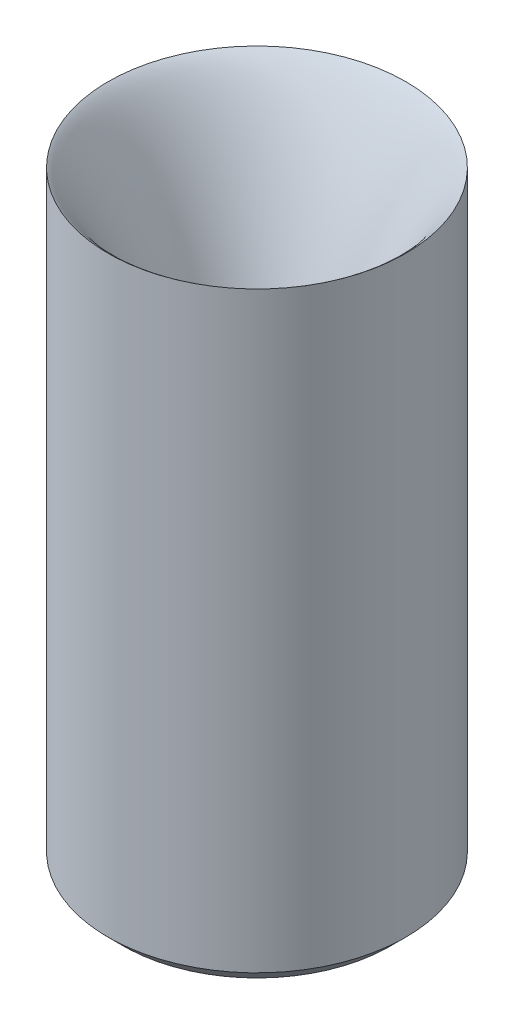
ISO-10303-21;
HEADER;
FILE_DESCRIPTION(('STEP AP214'),'2;1');
FILE_NAME('part.step','',(''),(''),'','','');
FILE_SCHEMA(('AUTOMOTIVE_DESIGN { 1 0 10303 214 1 1 1 1 }'));
ENDSEC;
DATA;
#1=APPLICATION_CONTEXT('core data for automotive mechanical design processes');
#2=APPLICATION_PROTOCOL_DEFINITION('international standard','automotive_design',2000,#1);
#3=PRODUCT_CONTEXT('',#1,'mechanical');
#4=PRODUCT('Part','Part','',(#3));
#5=PRODUCT_RELATED_PRODUCT_CATEGORY('part','',(#4));
#6=PRODUCT_DEFINITION_FORMATION('','',#4);
#7=PRODUCT_DEFINITION_CONTEXT('part definition',#1,'design');
#8=PRODUCT_DEFINITION('design','',#6,#7);
#9=PRODUCT_DEFINITION_SHAPE('','',#8);
#10=(LENGTH_UNIT() NAMED_UNIT(*) SI_UNIT(.MILLI.,.METRE.));
#11=(NAMED_UNIT(*) PLANE_ANGLE_UNIT() SI_UNIT($,.RADIAN.));
#12=(NAMED_UNIT(*) SI_UNIT($,.STERADIAN.) SOLID_ANGLE_UNIT());
#13=UNCERTAINTY_MEASURE_WITH_UNIT(LENGTH_MEASURE(1.E-05),#10,'distance_accuracy_value','');
#14=(GEOMETRIC_REPRESENTATION_CONTEXT(3) GLOBAL_UNCERTAINTY_ASSIGNED_CONTEXT((#13)) GLOBAL_UNIT_ASSIGNED_CONTEXT((#10,
#11,#12)) REPRESENTATION_CONTEXT('',''));
#15=CARTESIAN_POINT('',(0.,0.,0.));
#16=DIRECTION('',(0.,0.,1.));
#17=DIRECTION('',(1.,0.,0.));
#18=AXIS2_PLACEMENT_3D('',#15,#16,#17);
#19=CARTESIAN_POINT('',(0.,0.,0.));
#20=DIRECTION('',(0.,-1.,0.));
#21=DIRECTION('',(0.,0.,-1.));
#22=AXIS2_PLACEMENT_3D('',#19,#20,#21);
#23=CYLINDRICAL_SURFACE('',#22,1.5);
#24=CARTESIAN_POINT('',(0.,1.,0.));
#25=DIRECTION('',(0.,-1.,0.));
#26=DIRECTION('',(0.,0.,-1.));
#27=AXIS2_PLACEMENT_3D('',#24,#25,#26);
#28=CIRCLE('',#27,1.5);
#29=CARTESIAN_POINT('',(0.,1.,-1.5));
#30=VERTEX_POINT('',#29);
#31=EDGE_CURVE('E10',#30,#30,#28,.T.);
#32=ORIENTED_EDGE('',*,*,#31,.T.);
#33=EDGE_LOOP('',(#32));
#34=FACE_BOUND('',#33,.T.);
#35=CARTESIAN_POINT('',(0.,8.,0.));
#36=DIRECTION('',(0.,-1.,0.));
#37=DIRECTION('',(0.,0.,-1.));
#38=AXIS2_PLACEMENT_3D('',#35,#36,#37);
#39=CIRCLE('',#38,1.5);
#40=CARTESIAN_POINT('',(0.,8.,-1.5));
#41=VERTEX_POINT('',#40);
#42=EDGE_CURVE('E56',#41,#41,#39,.T.);
#43=ORIENTED_EDGE('',*,*,#42,.F.);
#44=EDGE_LOOP('',(#43));
#45=FACE_BOUND('',#44,.T.);
#46=ADVANCED_FACE('F35',(#34,#45),#23,.F.);
#47=CARTESIAN_POINT('',(0.9,8.,0.));
#48=DIRECTION('',(0.,-1.,0.));
#49=DIRECTION('',(0.,0.,-1.));
#50=AXIS2_PLACEMENT_3D('',#47,#48,#49);
#51=PLANE('',#50);
#52=ORIENTED_EDGE('',*,*,#42,.T.);
#53=EDGE_LOOP('',(#52));
#54=FACE_BOUND('',#53,.T.);
#55=CARTESIAN_POINT('',(0.,8.,0.));
#56=DIRECTION('',(0.,-1.,0.));
#57=DIRECTION('',(0.,0.,-1.));
#58=AXIS2_PLACEMENT_3D('',#55,#56,#57);
#59=CIRCLE('',#58,0.9);
#60=CARTESIAN_POINT('',(0.,8.,-0.9));
#61=VERTEX_POINT('',#60);
#62=EDGE_CURVE('E59',#61,#61,#59,.T.);
#63=ORIENTED_EDGE('',*,*,#62,.F.);
#64=EDGE_LOOP('',(#63));
#65=FACE_BOUND('',#64,.T.);
#66=ADVANCED_FACE('F85',(#54,#65),#51,.T.);
#67=CARTESIAN_POINT('',(0.,0.,0.));
#68=DIRECTION('',(0.,-1.,0.));
#69=DIRECTION('',(0.,0.,-1.));
#70=AXIS2_PLACEMENT_3D('',#67,#68,#69);
#71=CYLINDRICAL_SURFACE('',#70,0.9);
#72=ORIENTED_EDGE('',*,*,#62,.T.);
#73=EDGE_LOOP('',(#72));
#74=FACE_BOUND('',#73,.T.);
#75=CARTESIAN_POINT('',(0.,10.9999999999999,0.));
#76=DIRECTION('',(0.,-1.,0.));
#77=DIRECTION('',(0.,0.,-1.));
#78=AXIS2_PLACEMENT_3D('',#75,#76,#77);
#79=CIRCLE('',#78,0.899999999999999);
#80=CARTESIAN_POINT('',(0.,10.9999999999999,-0.899999999999999));
#81=VERTEX_POINT('',#80);
#82=EDGE_CURVE('E62',#81,#81,#79,.T.);
#83=ORIENTED_EDGE('',*,*,#82,.F.);
#84=EDGE_LOOP('',(#83));
#85=FACE_BOUND('',#84,.T.);
#86=ADVANCED_FACE('F80',(#74,#85),#71,.F.);
#87=CARTESIAN_POINT('',(9.8,40.,0.));
#88=CARTESIAN_POINT('',(7.45385891871025,38.434475284479,0.));
#89=CARTESIAN_POINT('',(0.899999999999884,21.9999999999998,0.));
#90=CARTESIAN_POINT('',(0.899999999999999,10.9999999999999,0.));
#91=B_SPLINE_CURVE_WITH_KNOTS('',3,(#87,#88,#89,#90),.UNSPECIFIED.,.F.,.F.,(4,4),(0.,1.),.UNSPECIFIED.);
#92=CARTESIAN_POINT('',(0.,0.,0.));
#93=DIRECTION('',(0.,-1.,0.));
#94=AXIS1_PLACEMENT('',#92,#93);
#95=SURFACE_OF_REVOLUTION('',#91,#94);
#96=ORIENTED_EDGE('',*,*,#82,.T.);
#97=EDGE_LOOP('',(#96));
#98=FACE_BOUND('',#97,.T.);
#99=CARTESIAN_POINT('',(0.,40.,0.));
#100=DIRECTION('',(0.,-1.,0.));
#101=DIRECTION('',(0.,0.,-1.));
#102=AXIS2_PLACEMENT_3D('',#99,#100,#101);
#103=CIRCLE('',#102,9.8);
#104=CARTESIAN_POINT('',(0.,40.,-9.8));
#105=VERTEX_POINT('',#104);
#106=EDGE_CURVE('E65',#105,#105,#103,.T.);
#107=ORIENTED_EDGE('',*,*,#106,.F.);
#108=EDGE_LOOP('',(#107));
#109=FACE_BOUND('',#108,.T.);
#110=ADVANCED_FACE('F75',(#98,#109),#95,.F.);
#111=CARTESIAN_POINT('',(0.,0.,0.));
#112=DIRECTION('',(0.,-1.,0.));
#113=DIRECTION('',(0.,0.,-1.));
#114=AXIS2_PLACEMENT_3D('',#111,#112,#113);
#115=CYLINDRICAL_SURFACE('',#114,9.8);
#116=CARTESIAN_POINT('',(0.,1.00000000000001,0.));
#117=DIRECTION('',(0.,-1.,0.));
#118=DIRECTION('',(0.,0.,-1.));
#119=AXIS2_PLACEMENT_3D('',#116,#117,#118);
#120=CIRCLE('',#119,9.8);
#121=CARTESIAN_POINT('',(0.,1.00000000000001,-9.8));
#122=VERTEX_POINT('',#121);
#123=EDGE_CURVE('E43',#122,#122,#120,.F.);
#124=ORIENTED_EDGE('',*,*,#123,.T.);
#125=EDGE_LOOP('',(#124));
#126=FACE_BOUND('',#125,.T.);
#127=ORIENTED_EDGE('',*,*,#106,.T.);
#128=EDGE_LOOP('',(#127));
#129=FACE_BOUND('',#128,.T.);
#130=ADVANCED_FACE('F79',(#126,#129),#115,.T.);
#131=CARTESIAN_POINT('',(1.5,0.,0.));
#132=DIRECTION('',(0.,-1.,0.));
#133=DIRECTION('',(0.,0.,-1.));
#134=AXIS2_PLACEMENT_3D('',#131,#132,#133);
#135=PLANE('',#134);
#136=CARTESIAN_POINT('',(0.,0.,0.));
#137=DIRECTION('',(0.,-1.,0.));
#138=DIRECTION('',(0.,0.,-1.));
#139=AXIS2_PLACEMENT_3D('',#136,#137,#138);
#140=CIRCLE('',#139,8.8);
#141=CARTESIAN_POINT('',(0.,0.,-8.8));
#142=VERTEX_POINT('',#141);
#143=EDGE_CURVE('E47',#142,#142,#140,.T.);
#144=ORIENTED_EDGE('',*,*,#143,.T.);
#145=EDGE_LOOP('',(#144));
#146=FACE_BOUND('',#145,.T.);
#147=CARTESIAN_POINT('',(0.,0.,0.));
#148=DIRECTION('',(0.,-1.,0.));
#149=DIRECTION('',(0.,0.,-1.));
#150=AXIS2_PLACEMENT_3D('',#147,#148,#149);
#151=CIRCLE('',#150,2.5);
#152=CARTESIAN_POINT('',(0.,0.,-2.5));
#153=VERTEX_POINT('',#152);
#154=EDGE_CURVE('E51',#153,#153,#151,.F.);
#155=ORIENTED_EDGE('',*,*,#154,.T.);
#156=EDGE_LOOP('',(#155));
#157=FACE_BOUND('',#156,.T.);
#158=ADVANCED_FACE('F96',(#146,#157),#135,.T.);
#159=CARTESIAN_POINT('',(0.,0.,0.));
#160=DIRECTION('',(0.,1.,0.));
#161=DIRECTION('',(0.,0.,1.));
#162=AXIS2_PLACEMENT_3D('',#159,#160,#161);
#163=CONICAL_SURFACE('',#162,8.8,0.785398163397445);
#164=ORIENTED_EDGE('',*,*,#123,.F.);
#165=EDGE_LOOP('',(#164));
#166=FACE_BOUND('',#165,.T.);
#167=ORIENTED_EDGE('',*,*,#143,.F.);
#168=EDGE_LOOP('',(#167));
#169=FACE_BOUND('',#168,.T.);
#170=ADVANCED_FACE('F92',(#166,#169),#163,.T.);
#171=CARTESIAN_POINT('',(0.,1.,0.));
#172=DIRECTION('',(0.,-1.,0.));
#173=DIRECTION('',(0.,0.,-1.));
#174=AXIS2_PLACEMENT_3D('',#171,#172,#173);
#175=CONICAL_SURFACE('',#174,1.5,0.785398163397449);
#176=ORIENTED_EDGE('',*,*,#154,.F.);
#177=EDGE_LOOP('',(#176));
#178=FACE_BOUND('',#177,.T.);
#179=ORIENTED_EDGE('',*,*,#31,.F.);
#180=EDGE_LOOP('',(#179));
#181=FACE_BOUND('',#180,.T.);
#182=ADVANCED_FACE('F38',(#178,#181),#175,.F.);
#183=CLOSED_SHELL('',(#46,#66,#86,#110,#130,#158,#170,#182));
#184=MANIFOLD_SOLID_BREP('B2',#183);
#185=ADVANCED_BREP_SHAPE_REPRESENTATION('',(#18,#184),#14);
#186=SHAPE_DEFINITION_REPRESENTATION(#9,#185);
ENDSEC;
END-ISO-10303-21;
